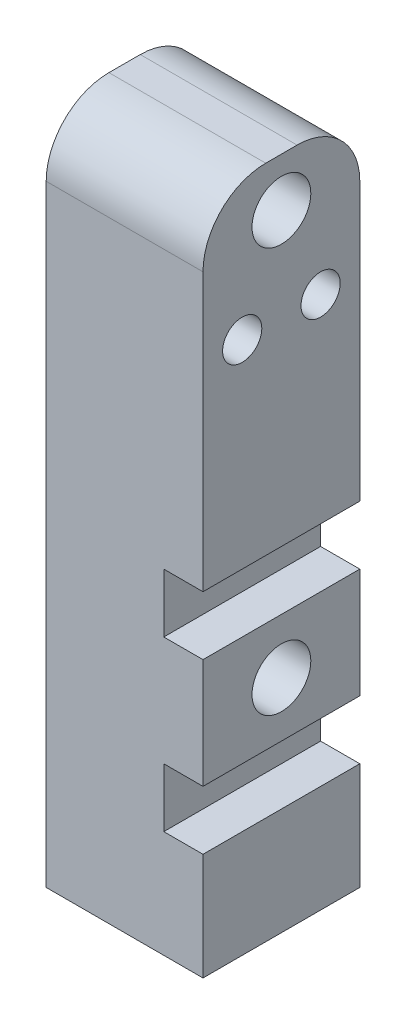
ISO-10303-21;
HEADER;
FILE_DESCRIPTION(('STEP AP214'),'2;1');
FILE_NAME('part.step','',(''),(''),'','','');
FILE_SCHEMA(('AUTOMOTIVE_DESIGN { 1 0 10303 214 1 1 1 1 }'));
ENDSEC;
DATA;
#1=APPLICATION_CONTEXT('core data for automotive mechanical design processes');
#2=APPLICATION_PROTOCOL_DEFINITION('international standard','automotive_design',2000,#1);
#3=PRODUCT_CONTEXT('',#1,'mechanical');
#4=PRODUCT('Part','Part','',(#3));
#5=PRODUCT_RELATED_PRODUCT_CATEGORY('part','',(#4));
#6=PRODUCT_DEFINITION_FORMATION('','',#4);
#7=PRODUCT_DEFINITION_CONTEXT('part definition',#1,'design');
#8=PRODUCT_DEFINITION('design','',#6,#7);
#9=PRODUCT_DEFINITION_SHAPE('','',#8);
#10=(LENGTH_UNIT() NAMED_UNIT(*) SI_UNIT(.MILLI.,.METRE.));
#11=(NAMED_UNIT(*) PLANE_ANGLE_UNIT() SI_UNIT($,.RADIAN.));
#12=(NAMED_UNIT(*) SI_UNIT($,.STERADIAN.) SOLID_ANGLE_UNIT());
#13=UNCERTAINTY_MEASURE_WITH_UNIT(LENGTH_MEASURE(1.E-05),#10,'distance_accuracy_value','');
#14=(GEOMETRIC_REPRESENTATION_CONTEXT(3) GLOBAL_UNCERTAINTY_ASSIGNED_CONTEXT((#13)) GLOBAL_UNIT_ASSIGNED_CONTEXT((#10,
#11,#12)) REPRESENTATION_CONTEXT('',''));
#15=CARTESIAN_POINT('',(0.,0.,0.));
#16=DIRECTION('',(0.,0.,1.));
#17=DIRECTION('',(1.,0.,0.));
#18=AXIS2_PLACEMENT_3D('',#15,#16,#17);
#19=CARTESIAN_POINT('',(25.4,0.,25.4));
#20=DIRECTION('',(0.,1.,0.));
#21=DIRECTION('',(0.,0.,1.));
#22=AXIS2_PLACEMENT_3D('',#19,#20,#21);
#23=PLANE('',#22);
#24=CARTESIAN_POINT('',(12.7,0.,12.7));
#25=DIRECTION('',(0.,-1.,0.));
#26=DIRECTION('',(0.,0.,-1.));
#27=AXIS2_PLACEMENT_3D('',#24,#25,#26);
#28=CIRCLE('',#27,3.175);
#29=CARTESIAN_POINT('',(12.7,0.,9.525));
#30=VERTEX_POINT('',#29);
#31=EDGE_CURVE('E549',#30,#30,#28,.T.);
#32=ORIENTED_EDGE('',*,*,#31,.F.);
#33=EDGE_LOOP('',(#32));
#34=FACE_BOUND('',#33,.T.);
#35=DIRECTION('',(1.,0.,0.));
#36=VECTOR('',#35,1.);
#37=CARTESIAN_POINT('',(25.4,0.,0.));
#38=LINE('',#37,#36);
#39=CARTESIAN_POINT('',(0.,0.,0.));
#40=VERTEX_POINT('',#39);
#41=CARTESIAN_POINT('',(25.4,0.,0.));
#42=VERTEX_POINT('',#41);
#43=EDGE_CURVE('E170',#40,#42,#38,.T.);
#44=ORIENTED_EDGE('',*,*,#43,.T.);
#45=DIRECTION('',(0.,0.,-1.));
#46=VECTOR('',#45,1.);
#47=CARTESIAN_POINT('',(25.4,0.,25.4));
#48=LINE('',#47,#46);
#49=CARTESIAN_POINT('',(25.4,0.,25.4));
#50=VERTEX_POINT('',#49);
#51=EDGE_CURVE('E151',#50,#42,#48,.T.);
#52=ORIENTED_EDGE('',*,*,#51,.F.);
#53=DIRECTION('',(1.,0.,0.));
#54=VECTOR('',#53,1.);
#55=CARTESIAN_POINT('',(25.4,0.,25.4));
#56=LINE('',#55,#54);
#57=CARTESIAN_POINT('',(0.,0.,25.4));
#58=VERTEX_POINT('',#57);
#59=EDGE_CURVE('E158',#58,#50,#56,.T.);
#60=ORIENTED_EDGE('',*,*,#59,.F.);
#61=DIRECTION('',(0.,0.,-1.));
#62=VECTOR('',#61,1.);
#63=CARTESIAN_POINT('',(0.,0.,25.4));
#64=LINE('',#63,#62);
#65=EDGE_CURVE('E211',#58,#40,#64,.T.);
#66=ORIENTED_EDGE('',*,*,#65,.T.);
#67=EDGE_LOOP('',(#44,#52,#60,#66));
#68=FACE_BOUND('',#67,.T.);
#69=ADVANCED_FACE('F42',(#34,#68),#23,.F.);
#70=CARTESIAN_POINT('',(25.4,17.3553714621183,25.4));
#71=DIRECTION('',(-1.,0.,0.));
#72=DIRECTION('',(0.,-1.,0.));
#73=AXIS2_PLACEMENT_3D('',#70,#71,#72);
#74=PLANE('',#73);
#75=DIRECTION('',(0.,1.,0.));
#76=VECTOR('',#75,1.);
#77=CARTESIAN_POINT('',(25.4,17.3553714621183,0.));
#78=LINE('',#77,#76);
#79=CARTESIAN_POINT('',(25.4,17.3553714621183,0.));
#80=VERTEX_POINT('',#79);
#81=EDGE_CURVE('E247',#42,#80,#78,.T.);
#82=ORIENTED_EDGE('',*,*,#81,.T.);
#83=DIRECTION('',(0.,0.,-1.));
#84=VECTOR('',#83,1.);
#85=CARTESIAN_POINT('',(25.4,17.3553714621183,25.4));
#86=LINE('',#85,#84);
#87=CARTESIAN_POINT('',(25.4,17.3553714621183,25.4));
#88=VERTEX_POINT('',#87);
#89=EDGE_CURVE('E154',#88,#80,#86,.T.);
#90=ORIENTED_EDGE('',*,*,#89,.F.);
#91=DIRECTION('',(0.,1.,0.));
#92=VECTOR('',#91,1.);
#93=CARTESIAN_POINT('',(25.4,17.3553714621183,25.4));
#94=LINE('',#93,#92);
#95=EDGE_CURVE('E147',#50,#88,#94,.T.);
#96=ORIENTED_EDGE('',*,*,#95,.F.);
#97=ORIENTED_EDGE('',*,*,#51,.T.);
#98=EDGE_LOOP('',(#82,#90,#96,#97));
#99=FACE_BOUND('',#98,.T.);
#100=ADVANCED_FACE('F149',(#99),#74,.F.);
#101=CARTESIAN_POINT('',(19.05,17.3553714621183,25.4));
#102=DIRECTION('',(0.,-1.,0.));
#103=DIRECTION('',(0.,0.,-1.));
#104=AXIS2_PLACEMENT_3D('',#101,#102,#103);
#105=PLANE('',#104);
#106=DIRECTION('',(-1.,0.,0.));
#107=VECTOR('',#106,1.);
#108=CARTESIAN_POINT('',(19.05,17.3553714621183,0.));
#109=LINE('',#108,#107);
#110=CARTESIAN_POINT('',(19.05,17.3553714621183,0.));
#111=VERTEX_POINT('',#110);
#112=EDGE_CURVE('E241',#80,#111,#109,.T.);
#113=ORIENTED_EDGE('',*,*,#112,.T.);
#114=DIRECTION('',(0.,0.,-1.));
#115=VECTOR('',#114,1.);
#116=CARTESIAN_POINT('',(19.05,17.3553714621183,25.4));
#117=LINE('',#116,#115);
#118=CARTESIAN_POINT('',(19.05,17.3553714621183,25.4));
#119=VERTEX_POINT('',#118);
#120=EDGE_CURVE('E175',#119,#111,#117,.T.);
#121=ORIENTED_EDGE('',*,*,#120,.F.);
#122=DIRECTION('',(-1.,0.,0.));
#123=VECTOR('',#122,1.);
#124=CARTESIAN_POINT('',(19.05,17.3553714621183,25.4));
#125=LINE('',#124,#123);
#126=EDGE_CURVE('E157',#88,#119,#125,.T.);
#127=ORIENTED_EDGE('',*,*,#126,.F.);
#128=ORIENTED_EDGE('',*,*,#89,.T.);
#129=EDGE_LOOP('',(#113,#121,#127,#128));
#130=FACE_BOUND('',#129,.T.);
#131=ADVANCED_FACE('F272',(#130),#105,.F.);
#132=CARTESIAN_POINT('',(19.05,26.8803714621183,25.4));
#133=DIRECTION('',(-1.,0.,0.));
#134=DIRECTION('',(0.,0.,1.));
#135=AXIS2_PLACEMENT_3D('',#132,#133,#134);
#136=PLANE('',#135);
#137=DIRECTION('',(0.,1.,0.));
#138=VECTOR('',#137,1.);
#139=CARTESIAN_POINT('',(19.05,26.8803714621183,0.));
#140=LINE('',#139,#138);
#141=CARTESIAN_POINT('',(19.05,26.8803714621183,0.));
#142=VERTEX_POINT('',#141);
#143=EDGE_CURVE('E236',#111,#142,#140,.T.);
#144=ORIENTED_EDGE('',*,*,#143,.T.);
#145=DIRECTION('',(0.,0.,-1.));
#146=VECTOR('',#145,1.);
#147=CARTESIAN_POINT('',(19.05,26.8803714621183,25.4));
#148=LINE('',#147,#146);
#149=CARTESIAN_POINT('',(19.05,26.8803714621183,25.4));
#150=VERTEX_POINT('',#149);
#151=EDGE_CURVE('E227',#150,#142,#148,.T.);
#152=ORIENTED_EDGE('',*,*,#151,.F.);
#153=DIRECTION('',(0.,1.,0.));
#154=VECTOR('',#153,1.);
#155=CARTESIAN_POINT('',(19.05,26.8803714621183,25.4));
#156=LINE('',#155,#154);
#157=EDGE_CURVE('E237',#119,#150,#156,.T.);
#158=ORIENTED_EDGE('',*,*,#157,.F.);
#159=ORIENTED_EDGE('',*,*,#120,.T.);
#160=EDGE_LOOP('',(#144,#152,#158,#159));
#161=FACE_BOUND('',#160,.T.);
#162=ADVANCED_FACE('F234',(#161),#136,.F.);
#163=CARTESIAN_POINT('',(25.4,26.8803714621183,25.4));
#164=DIRECTION('',(0.,1.,0.));
#165=DIRECTION('',(0.,0.,1.));
#166=AXIS2_PLACEMENT_3D('',#163,#164,#165);
#167=PLANE('',#166);
#168=DIRECTION('',(1.,0.,0.));
#169=VECTOR('',#168,1.);
#170=CARTESIAN_POINT('',(25.4,26.8803714621183,0.));
#171=LINE('',#170,#169);
#172=CARTESIAN_POINT('',(25.4,26.8803714621183,0.));
#173=VERTEX_POINT('',#172);
#174=EDGE_CURVE('E243',#142,#173,#171,.T.);
#175=ORIENTED_EDGE('',*,*,#174,.T.);
#176=DIRECTION('',(0.,0.,-1.));
#177=VECTOR('',#176,1.);
#178=CARTESIAN_POINT('',(25.4,26.8803714621183,25.4));
#179=LINE('',#178,#177);
#180=CARTESIAN_POINT('',(25.4,26.8803714621183,25.4));
#181=VERTEX_POINT('',#180);
#182=EDGE_CURVE('E224',#181,#173,#179,.T.);
#183=ORIENTED_EDGE('',*,*,#182,.F.);
#184=DIRECTION('',(1.,0.,0.));
#185=VECTOR('',#184,1.);
#186=CARTESIAN_POINT('',(25.4,26.8803714621183,25.4));
#187=LINE('',#186,#185);
#188=EDGE_CURVE('E274',#150,#181,#187,.T.);
#189=ORIENTED_EDGE('',*,*,#188,.F.);
#190=ORIENTED_EDGE('',*,*,#151,.T.);
#191=EDGE_LOOP('',(#175,#183,#189,#190));
#192=FACE_BOUND('',#191,.T.);
#193=ADVANCED_FACE('F296',(#192),#167,.F.);
#194=CARTESIAN_POINT('',(25.4,44.6603714621183,25.4));
#195=DIRECTION('',(-1.,0.,0.));
#196=DIRECTION('',(0.,0.,1.));
#197=AXIS2_PLACEMENT_3D('',#194,#195,#196);
#198=PLANE('',#197);
#199=CARTESIAN_POINT('',(25.4,35.7703714621183,12.7));
#200=DIRECTION('',(1.,0.,0.));
#201=DIRECTION('',(0.,0.,-1.));
#202=AXIS2_PLACEMENT_3D('',#199,#200,#201);
#203=CIRCLE('',#202,4.7625);
#204=CARTESIAN_POINT('',(25.4,35.7703714621183,7.9375));
#205=VERTEX_POINT('',#204);
#206=EDGE_CURVE('E563',#205,#205,#203,.T.);
#207=ORIENTED_EDGE('',*,*,#206,.F.);
#208=EDGE_LOOP('',(#207));
#209=FACE_BOUND('',#208,.T.);
#210=DIRECTION('',(0.,1.,0.));
#211=VECTOR('',#210,1.);
#212=CARTESIAN_POINT('',(25.4,44.6603714621183,0.));
#213=LINE('',#212,#211);
#214=CARTESIAN_POINT('',(25.4,44.6603714621183,0.));
#215=VERTEX_POINT('',#214);
#216=EDGE_CURVE('E245',#173,#215,#213,.T.);
#217=ORIENTED_EDGE('',*,*,#216,.T.);
#218=DIRECTION('',(0.,0.,-1.));
#219=VECTOR('',#218,1.);
#220=CARTESIAN_POINT('',(25.4,44.6603714621183,25.4));
#221=LINE('',#220,#219);
#222=CARTESIAN_POINT('',(25.4,44.6603714621183,25.4));
#223=VERTEX_POINT('',#222);
#224=EDGE_CURVE('E221',#223,#215,#221,.T.);
#225=ORIENTED_EDGE('',*,*,#224,.F.);
#226=DIRECTION('',(0.,1.,0.));
#227=VECTOR('',#226,1.);
#228=CARTESIAN_POINT('',(25.4,44.6603714621183,25.4));
#229=LINE('',#228,#227);
#230=EDGE_CURVE('E278',#181,#223,#229,.T.);
#231=ORIENTED_EDGE('',*,*,#230,.F.);
#232=ORIENTED_EDGE('',*,*,#182,.T.);
#233=EDGE_LOOP('',(#217,#225,#231,#232));
#234=FACE_BOUND('',#233,.T.);
#235=ADVANCED_FACE('F292',(#209,#234),#198,.F.);
#236=CARTESIAN_POINT('',(19.05,44.6603714621183,25.4));
#237=DIRECTION('',(0.,-1.,0.));
#238=DIRECTION('',(1.,0.,0.));
#239=AXIS2_PLACEMENT_3D('',#236,#237,#238);
#240=PLANE('',#239);
#241=DIRECTION('',(-1.,0.,0.));
#242=VECTOR('',#241,1.);
#243=CARTESIAN_POINT('',(19.05,44.6603714621183,0.));
#244=LINE('',#243,#242);
#245=CARTESIAN_POINT('',(19.05,44.6603714621183,0.));
#246=VERTEX_POINT('',#245);
#247=EDGE_CURVE('E252',#215,#246,#244,.T.);
#248=ORIENTED_EDGE('',*,*,#247,.T.);
#249=DIRECTION('',(0.,0.,-1.));
#250=VECTOR('',#249,1.);
#251=CARTESIAN_POINT('',(19.05,44.6603714621183,25.4));
#252=LINE('',#251,#250);
#253=CARTESIAN_POINT('',(19.05,44.6603714621183,25.4));
#254=VERTEX_POINT('',#253);
#255=EDGE_CURVE('E218',#254,#246,#252,.T.);
#256=ORIENTED_EDGE('',*,*,#255,.F.);
#257=DIRECTION('',(-1.,0.,0.));
#258=VECTOR('',#257,1.);
#259=CARTESIAN_POINT('',(19.05,44.6603714621183,25.4));
#260=LINE('',#259,#258);
#261=EDGE_CURVE('E280',#223,#254,#260,.T.);
#262=ORIENTED_EDGE('',*,*,#261,.F.);
#263=ORIENTED_EDGE('',*,*,#224,.T.);
#264=EDGE_LOOP('',(#248,#256,#262,#263));
#265=FACE_BOUND('',#264,.T.);
#266=ADVANCED_FACE('F288',(#265),#240,.F.);
#267=CARTESIAN_POINT('',(19.05,54.1853714621183,25.4));
#268=DIRECTION('',(-1.,0.,0.));
#269=DIRECTION('',(0.,0.,1.));
#270=AXIS2_PLACEMENT_3D('',#267,#268,#269);
#271=PLANE('',#270);
#272=DIRECTION('',(0.,1.,0.));
#273=VECTOR('',#272,1.);
#274=CARTESIAN_POINT('',(19.05,54.1853714621183,0.));
#275=LINE('',#274,#273);
#276=CARTESIAN_POINT('',(19.05,54.1853714621183,0.));
#277=VERTEX_POINT('',#276);
#278=EDGE_CURVE('E254',#246,#277,#275,.T.);
#279=ORIENTED_EDGE('',*,*,#278,.T.);
#280=DIRECTION('',(0.,0.,-1.));
#281=VECTOR('',#280,1.);
#282=CARTESIAN_POINT('',(19.05,54.1853714621183,25.4));
#283=LINE('',#282,#281);
#284=CARTESIAN_POINT('',(19.05,54.1853714621183,25.4));
#285=VERTEX_POINT('',#284);
#286=EDGE_CURVE('E215',#285,#277,#283,.T.);
#287=ORIENTED_EDGE('',*,*,#286,.F.);
#288=DIRECTION('',(0.,1.,0.));
#289=VECTOR('',#288,1.);
#290=CARTESIAN_POINT('',(19.05,54.1853714621183,25.4));
#291=LINE('',#290,#289);
#292=EDGE_CURVE('E267',#254,#285,#291,.T.);
#293=ORIENTED_EDGE('',*,*,#292,.F.);
#294=ORIENTED_EDGE('',*,*,#255,.T.);
#295=EDGE_LOOP('',(#279,#287,#293,#294));
#296=FACE_BOUND('',#295,.T.);
#297=ADVANCED_FACE('F285',(#296),#271,.F.);
#298=CARTESIAN_POINT('',(25.4,54.1853714621183,25.4));
#299=DIRECTION('',(0.,1.,0.));
#300=DIRECTION('',(-1.,0.,0.));
#301=AXIS2_PLACEMENT_3D('',#298,#299,#300);
#302=PLANE('',#301);
#303=DIRECTION('',(1.,0.,0.));
#304=VECTOR('',#303,1.);
#305=CARTESIAN_POINT('',(25.4,54.1853714621183,0.));
#306=LINE('',#305,#304);
#307=CARTESIAN_POINT('',(25.4,54.1853714621183,0.));
#308=VERTEX_POINT('',#307);
#309=EDGE_CURVE('E207',#277,#308,#306,.T.);
#310=ORIENTED_EDGE('',*,*,#309,.T.);
#311=DIRECTION('',(0.,0.,-1.));
#312=VECTOR('',#311,1.);
#313=CARTESIAN_POINT('',(25.4,54.1853714621183,25.4));
#314=LINE('',#313,#312);
#315=CARTESIAN_POINT('',(25.4,54.1853714621183,25.4));
#316=VERTEX_POINT('',#315);
#317=EDGE_CURVE('E199',#316,#308,#314,.T.);
#318=ORIENTED_EDGE('',*,*,#317,.F.);
#319=DIRECTION('',(1.,0.,0.));
#320=VECTOR('',#319,1.);
#321=CARTESIAN_POINT('',(25.4,54.1853714621183,25.4));
#322=LINE('',#321,#320);
#323=EDGE_CURVE('E264',#285,#316,#322,.T.);
#324=ORIENTED_EDGE('',*,*,#323,.F.);
#325=ORIENTED_EDGE('',*,*,#286,.T.);
#326=EDGE_LOOP('',(#310,#318,#324,#325));
#327=FACE_BOUND('',#326,.T.);
#328=ADVANCED_FACE('F258',(#327),#302,.F.);
#329=CARTESIAN_POINT('',(25.4,109.22,25.4));
#330=DIRECTION('',(-1.,0.,0.));
#331=DIRECTION('',(0.,-1.,0.));
#332=AXIS2_PLACEMENT_3D('',#329,#330,#331);
#333=PLANE('',#332);
#334=CARTESIAN_POINT('',(25.4,101.346,12.7));
#335=DIRECTION('',(1.,0.,0.));
#336=DIRECTION('',(0.,1.,0.));
#337=AXIS2_PLACEMENT_3D('',#334,#335,#336);
#338=CIRCLE('',#337,4.7625);
#339=CARTESIAN_POINT('',(25.4,106.1085,12.7));
#340=VERTEX_POINT('',#339);
#341=EDGE_CURVE('E548',#340,#340,#338,.T.);
#342=ORIENTED_EDGE('',*,*,#341,.F.);
#343=EDGE_LOOP('',(#342));
#344=FACE_BOUND('',#343,.T.);
#345=CARTESIAN_POINT('',(25.4,86.36,19.05));
#346=DIRECTION('',(1.,0.,0.));
#347=DIRECTION('',(0.,1.,0.));
#348=AXIS2_PLACEMENT_3D('',#345,#346,#347);
#349=CIRCLE('',#348,3.175);
#350=CARTESIAN_POINT('',(25.4,89.535,19.05));
#351=VERTEX_POINT('',#350);
#352=EDGE_CURVE('E564',#351,#351,#349,.T.);
#353=ORIENTED_EDGE('',*,*,#352,.F.);
#354=EDGE_LOOP('',(#353));
#355=FACE_BOUND('',#354,.T.);
#356=CARTESIAN_POINT('',(25.4,86.36,6.35));
#357=DIRECTION('',(1.,0.,0.));
#358=DIRECTION('',(0.,1.,0.));
#359=AXIS2_PLACEMENT_3D('',#356,#357,#358);
#360=CIRCLE('',#359,3.175);
#361=CARTESIAN_POINT('',(25.4,89.535,6.35));
#362=VERTEX_POINT('',#361);
#363=EDGE_CURVE('E567',#362,#362,#360,.T.);
#364=ORIENTED_EDGE('',*,*,#363,.F.);
#365=EDGE_LOOP('',(#364));
#366=FACE_BOUND('',#365,.T.);
#367=DIRECTION('',(0.,1.,0.));
#368=VECTOR('',#367,1.);
#369=CARTESIAN_POINT('',(25.4,109.22,0.));
#370=LINE('',#369,#368);
#371=CARTESIAN_POINT('',(25.4,99.06,0.));
#372=VERTEX_POINT('',#371);
#373=EDGE_CURVE('E191',#308,#372,#370,.T.);
#374=ORIENTED_EDGE('',*,*,#373,.T.);
#375=CARTESIAN_POINT('',(25.4,99.06,10.16));
#376=DIRECTION('',(-1.,0.,0.));
#377=DIRECTION('',(0.,-1.,0.));
#378=AXIS2_PLACEMENT_3D('',#375,#376,#377);
#379=CIRCLE('',#378,10.16);
#380=CARTESIAN_POINT('',(25.4,109.22,10.16));
#381=VERTEX_POINT('',#380);
#382=EDGE_CURVE('E50',#372,#381,#379,.F.);
#383=ORIENTED_EDGE('',*,*,#382,.T.);
#384=DIRECTION('',(0.,0.,-1.));
#385=VECTOR('',#384,1.);
#386=CARTESIAN_POINT('',(25.4,109.22,25.4));
#387=LINE('',#386,#385);
#388=CARTESIAN_POINT('',(25.4,109.22,15.24));
#389=VERTEX_POINT('',#388);
#390=EDGE_CURVE('E189',#389,#381,#387,.T.);
#391=ORIENTED_EDGE('',*,*,#390,.F.);
#392=CARTESIAN_POINT('',(25.4,99.06,15.24));
#393=DIRECTION('',(-1.,0.,0.));
#394=DIRECTION('',(0.,-1.,0.));
#395=AXIS2_PLACEMENT_3D('',#392,#393,#394);
#396=CIRCLE('',#395,10.16);
#397=CARTESIAN_POINT('',(25.4,99.06,25.4));
#398=VERTEX_POINT('',#397);
#399=EDGE_CURVE('E57',#389,#398,#396,.F.);
#400=ORIENTED_EDGE('',*,*,#399,.T.);
#401=DIRECTION('',(0.,1.,0.));
#402=VECTOR('',#401,1.);
#403=CARTESIAN_POINT('',(25.4,109.22,25.4));
#404=LINE('',#403,#402);
#405=EDGE_CURVE('E262',#316,#398,#404,.T.);
#406=ORIENTED_EDGE('',*,*,#405,.F.);
#407=ORIENTED_EDGE('',*,*,#317,.T.);
#408=EDGE_LOOP('',(#374,#383,#391,#400,#406,#407));
#409=FACE_BOUND('',#408,.T.);
#410=ADVANCED_FACE('F188',(#344,#355,#366,#409),#333,.F.);
#411=CARTESIAN_POINT('',(0.,109.22,25.4));
#412=DIRECTION('',(0.,-1.,0.));
#413=DIRECTION('',(0.,0.,-1.));
#414=AXIS2_PLACEMENT_3D('',#411,#412,#413);
#415=PLANE('',#414);
#416=ORIENTED_EDGE('',*,*,#390,.T.);
#417=DIRECTION('',(-1.,0.,0.));
#418=VECTOR('',#417,1.);
#419=CARTESIAN_POINT('',(0.,109.22,10.16));
#420=LINE('',#419,#418);
#421=CARTESIAN_POINT('',(0.,109.22,10.16));
#422=VERTEX_POINT('',#421);
#423=EDGE_CURVE('E173',#381,#422,#420,.T.);
#424=ORIENTED_EDGE('',*,*,#423,.T.);
#425=DIRECTION('',(0.,0.,-1.));
#426=VECTOR('',#425,1.);
#427=CARTESIAN_POINT('',(0.,109.22,25.4));
#428=LINE('',#427,#426);
#429=CARTESIAN_POINT('',(0.,109.22,15.24));
#430=VERTEX_POINT('',#429);
#431=EDGE_CURVE('E200',#430,#422,#428,.T.);
#432=ORIENTED_EDGE('',*,*,#431,.F.);
#433=DIRECTION('',(-1.,0.,0.));
#434=VECTOR('',#433,1.);
#435=CARTESIAN_POINT('',(0.,109.22,15.24));
#436=LINE('',#435,#434);
#437=EDGE_CURVE('E171',#430,#389,#436,.F.);
#438=ORIENTED_EDGE('',*,*,#437,.T.);
#439=EDGE_LOOP('',(#416,#424,#432,#438));
#440=FACE_BOUND('',#439,.T.);
#441=ADVANCED_FACE('F195',(#440),#415,.F.);
#442=CARTESIAN_POINT('',(0.,0.,25.4));
#443=DIRECTION('',(1.,0.,0.));
#444=DIRECTION('',(0.,0.,-1.));
#445=AXIS2_PLACEMENT_3D('',#442,#443,#444);
#446=PLANE('',#445);
#447=CARTESIAN_POINT('',(0.,86.36,19.05));
#448=DIRECTION('',(1.,0.,0.));
#449=DIRECTION('',(0.,1.,0.));
#450=AXIS2_PLACEMENT_3D('',#447,#448,#449);
#451=CIRCLE('',#450,3.175);
#452=CARTESIAN_POINT('',(0.,89.535,19.05));
#453=VERTEX_POINT('',#452);
#454=EDGE_CURVE('E560',#453,#453,#451,.T.);
#455=ORIENTED_EDGE('',*,*,#454,.T.);
#456=EDGE_LOOP('',(#455));
#457=FACE_BOUND('',#456,.T.);
#458=CARTESIAN_POINT('',(0.,86.36,6.35));
#459=DIRECTION('',(1.,0.,0.));
#460=DIRECTION('',(0.,1.,0.));
#461=AXIS2_PLACEMENT_3D('',#458,#459,#460);
#462=CIRCLE('',#461,3.175);
#463=CARTESIAN_POINT('',(0.,89.535,6.35));
#464=VERTEX_POINT('',#463);
#465=EDGE_CURVE('E558',#464,#464,#462,.T.);
#466=ORIENTED_EDGE('',*,*,#465,.T.);
#467=EDGE_LOOP('',(#466));
#468=FACE_BOUND('',#467,.T.);
#469=CARTESIAN_POINT('',(0.,35.7703714621183,12.7));
#470=DIRECTION('',(1.,0.,0.));
#471=DIRECTION('',(0.,0.,-1.));
#472=AXIS2_PLACEMENT_3D('',#469,#470,#471);
#473=CIRCLE('',#472,4.7625);
#474=CARTESIAN_POINT('',(0.,35.7703714621183,7.9375));
#475=VERTEX_POINT('',#474);
#476=EDGE_CURVE('E271',#475,#475,#473,.T.);
#477=ORIENTED_EDGE('',*,*,#476,.T.);
#478=EDGE_LOOP('',(#477));
#479=FACE_BOUND('',#478,.T.);
#480=ORIENTED_EDGE('',*,*,#431,.T.);
#481=CARTESIAN_POINT('',(0.,99.06,10.16));
#482=DIRECTION('',(1.,0.,0.));
#483=DIRECTION('',(0.,0.,-1.));
#484=AXIS2_PLACEMENT_3D('',#481,#482,#483);
#485=CIRCLE('',#484,10.16);
#486=CARTESIAN_POINT('',(0.,99.06,0.));
#487=VERTEX_POINT('',#486);
#488=EDGE_CURVE('E183',#422,#487,#485,.F.);
#489=ORIENTED_EDGE('',*,*,#488,.T.);
#490=DIRECTION('',(0.,-1.,0.));
#491=VECTOR('',#490,1.);
#492=CARTESIAN_POINT('',(0.,0.,0.));
#493=LINE('',#492,#491);
#494=EDGE_CURVE('E167',#487,#40,#493,.T.);
#495=ORIENTED_EDGE('',*,*,#494,.T.);
#496=ORIENTED_EDGE('',*,*,#65,.F.);
#497=DIRECTION('',(0.,-1.,0.));
#498=VECTOR('',#497,1.);
#499=CARTESIAN_POINT('',(0.,0.,25.4));
#500=LINE('',#499,#498);
#501=CARTESIAN_POINT('',(0.,99.06,25.4));
#502=VERTEX_POINT('',#501);
#503=EDGE_CURVE('E163',#502,#58,#500,.T.);
#504=ORIENTED_EDGE('',*,*,#503,.F.);
#505=CARTESIAN_POINT('',(0.,99.06,15.24));
#506=DIRECTION('',(1.,0.,0.));
#507=DIRECTION('',(0.,0.,-1.));
#508=AXIS2_PLACEMENT_3D('',#505,#506,#507);
#509=CIRCLE('',#508,10.16);
#510=EDGE_CURVE('E181',#502,#430,#509,.F.);
#511=ORIENTED_EDGE('',*,*,#510,.T.);
#512=EDGE_LOOP('',(#480,#489,#495,#496,#504,#511));
#513=FACE_BOUND('',#512,.T.);
#514=ADVANCED_FACE('F204',(#457,#468,#479,#513),#446,.F.);
#515=CARTESIAN_POINT('',(0.,0.,25.4));
#516=DIRECTION('',(0.,0.,-1.));
#517=DIRECTION('',(-1.,0.,0.));
#518=AXIS2_PLACEMENT_3D('',#515,#516,#517);
#519=PLANE('',#518);
#520=ORIENTED_EDGE('',*,*,#405,.T.);
#521=DIRECTION('',(-1.,0.,0.));
#522=VECTOR('',#521,1.);
#523=CARTESIAN_POINT('',(0.,99.06,25.4));
#524=LINE('',#523,#522);
#525=EDGE_CURVE('E11',#398,#502,#524,.T.);
#526=ORIENTED_EDGE('',*,*,#525,.T.);
#527=ORIENTED_EDGE('',*,*,#503,.T.);
#528=ORIENTED_EDGE('',*,*,#59,.T.);
#529=ORIENTED_EDGE('',*,*,#95,.T.);
#530=ORIENTED_EDGE('',*,*,#126,.T.);
#531=ORIENTED_EDGE('',*,*,#157,.T.);
#532=ORIENTED_EDGE('',*,*,#188,.T.);
#533=ORIENTED_EDGE('',*,*,#230,.T.);
#534=ORIENTED_EDGE('',*,*,#261,.T.);
#535=ORIENTED_EDGE('',*,*,#292,.T.);
#536=ORIENTED_EDGE('',*,*,#323,.T.);
#537=EDGE_LOOP('',(#520,#526,#527,#528,#529,#530,#531,#532,#533,#534,#535,#536));
#538=FACE_BOUND('',#537,.T.);
#539=ADVANCED_FACE('F161',(#538),#519,.F.);
#540=CARTESIAN_POINT('',(0.,0.,0.));
#541=DIRECTION('',(0.,0.,-1.));
#542=DIRECTION('',(-1.,0.,0.));
#543=AXIS2_PLACEMENT_3D('',#540,#541,#542);
#544=PLANE('',#543);
#545=ORIENTED_EDGE('',*,*,#494,.F.);
#546=DIRECTION('',(-1.,0.,0.));
#547=VECTOR('',#546,1.);
#548=CARTESIAN_POINT('',(25.4,99.06,0.));
#549=LINE('',#548,#547);
#550=EDGE_CURVE('E65',#487,#372,#549,.F.);
#551=ORIENTED_EDGE('',*,*,#550,.T.);
#552=ORIENTED_EDGE('',*,*,#373,.F.);
#553=ORIENTED_EDGE('',*,*,#309,.F.);
#554=ORIENTED_EDGE('',*,*,#278,.F.);
#555=ORIENTED_EDGE('',*,*,#247,.F.);
#556=ORIENTED_EDGE('',*,*,#216,.F.);
#557=ORIENTED_EDGE('',*,*,#174,.F.);
#558=ORIENTED_EDGE('',*,*,#143,.F.);
#559=ORIENTED_EDGE('',*,*,#112,.F.);
#560=ORIENTED_EDGE('',*,*,#81,.F.);
#561=ORIENTED_EDGE('',*,*,#43,.F.);
#562=EDGE_LOOP('',(#545,#551,#552,#553,#554,#555,#556,#557,#558,#559,#560,#561));
#563=FACE_BOUND('',#562,.T.);
#564=ADVANCED_FACE('F205',(#563),#544,.T.);
#565=CARTESIAN_POINT('',(0.,99.06,10.16));
#566=DIRECTION('',(1.,0.,0.));
#567=DIRECTION('',(0.,0.,-1.));
#568=AXIS2_PLACEMENT_3D('',#565,#566,#567);
#569=CYLINDRICAL_SURFACE('',#568,10.16);
#570=ORIENTED_EDGE('',*,*,#382,.F.);
#571=ORIENTED_EDGE('',*,*,#550,.F.);
#572=ORIENTED_EDGE('',*,*,#488,.F.);
#573=ORIENTED_EDGE('',*,*,#423,.F.);
#574=EDGE_LOOP('',(#570,#571,#572,#573));
#575=FACE_BOUND('',#574,.T.);
#576=ADVANCED_FACE('F202',(#575),#569,.T.);
#577=CARTESIAN_POINT('',(0.,99.06,15.24));
#578=DIRECTION('',(-1.,0.,0.));
#579=DIRECTION('',(0.,0.,1.));
#580=AXIS2_PLACEMENT_3D('',#577,#578,#579);
#581=CYLINDRICAL_SURFACE('',#580,10.16);
#582=ORIENTED_EDGE('',*,*,#399,.F.);
#583=ORIENTED_EDGE('',*,*,#437,.F.);
#584=ORIENTED_EDGE('',*,*,#510,.F.);
#585=ORIENTED_EDGE('',*,*,#525,.F.);
#586=EDGE_LOOP('',(#582,#583,#584,#585));
#587=FACE_BOUND('',#586,.T.);
#588=ADVANCED_FACE('F44',(#587),#581,.T.);
#589=CARTESIAN_POINT('',(0.,35.7703714621183,12.7));
#590=DIRECTION('',(1.,0.,0.));
#591=DIRECTION('',(0.,0.,-1.));
#592=AXIS2_PLACEMENT_3D('',#589,#590,#591);
#593=CYLINDRICAL_SURFACE('',#592,4.7625);
#594=ORIENTED_EDGE('',*,*,#476,.F.);
#595=EDGE_LOOP('',(#594));
#596=FACE_BOUND('',#595,.T.);
#597=ORIENTED_EDGE('',*,*,#206,.T.);
#598=EDGE_LOOP('',(#597));
#599=FACE_BOUND('',#598,.T.);
#600=ADVANCED_FACE('F322',(#596,#599),#593,.F.);
#601=CARTESIAN_POINT('',(0.,86.36,6.35));
#602=DIRECTION('',(1.,0.,0.));
#603=DIRECTION('',(0.,1.,0.));
#604=AXIS2_PLACEMENT_3D('',#601,#602,#603);
#605=CYLINDRICAL_SURFACE('',#604,3.175);
#606=ORIENTED_EDGE('',*,*,#465,.F.);
#607=EDGE_LOOP('',(#606));
#608=FACE_BOUND('',#607,.T.);
#609=ORIENTED_EDGE('',*,*,#363,.T.);
#610=EDGE_LOOP('',(#609));
#611=FACE_BOUND('',#610,.T.);
#612=ADVANCED_FACE('F407',(#608,#611),#605,.F.);
#613=CARTESIAN_POINT('',(0.,86.36,19.05));
#614=DIRECTION('',(1.,0.,0.));
#615=DIRECTION('',(0.,1.,0.));
#616=AXIS2_PLACEMENT_3D('',#613,#614,#615);
#617=CYLINDRICAL_SURFACE('',#616,3.175);
#618=ORIENTED_EDGE('',*,*,#454,.F.);
#619=EDGE_LOOP('',(#618));
#620=FACE_BOUND('',#619,.T.);
#621=ORIENTED_EDGE('',*,*,#352,.T.);
#622=EDGE_LOOP('',(#621));
#623=FACE_BOUND('',#622,.T.);
#624=ADVANCED_FACE('F417',(#620,#623),#617,.F.);
#625=CARTESIAN_POINT('',(8.88999999999998,101.346,12.7));
#626=DIRECTION('',(1.,0.,0.));
#627=DIRECTION('',(0.,1.,0.));
#628=AXIS2_PLACEMENT_3D('',#625,#626,#627);
#629=CYLINDRICAL_SURFACE('',#628,4.7625);
#630=CARTESIAN_POINT('',(8.88999999999998,101.346,12.7));
#631=DIRECTION('',(1.,0.,0.));
#632=DIRECTION('',(0.,1.,0.));
#633=AXIS2_PLACEMENT_3D('',#630,#631,#632);
#634=CIRCLE('',#633,4.7625);
#635=CARTESIAN_POINT('',(8.88999999999998,106.1085,12.7));
#636=VERTEX_POINT('',#635);
#637=EDGE_CURVE('E552',#636,#636,#634,.T.);
#638=ORIENTED_EDGE('',*,*,#637,.F.);
#639=EDGE_LOOP('',(#638));
#640=FACE_BOUND('',#639,.T.);
#641=ORIENTED_EDGE('',*,*,#341,.T.);
#642=EDGE_LOOP('',(#641));
#643=FACE_BOUND('',#642,.T.);
#644=ADVANCED_FACE('F423',(#640,#643),#629,.F.);
#645=CARTESIAN_POINT('',(8.88999999999998,101.346,12.7));
#646=DIRECTION('',(1.,0.,0.));
#647=DIRECTION('',(0.,1.,0.));
#648=AXIS2_PLACEMENT_3D('',#645,#646,#647);
#649=PLANE('',#648);
#650=ORIENTED_EDGE('',*,*,#637,.T.);
#651=EDGE_LOOP('',(#650));
#652=FACE_BOUND('',#651,.T.);
#653=ADVANCED_FACE('F430',(#652),#649,.T.);
#654=CARTESIAN_POINT('',(12.7,17.78,12.7));
#655=DIRECTION('',(0.,-1.,0.));
#656=DIRECTION('',(0.,0.,-1.));
#657=AXIS2_PLACEMENT_3D('',#654,#655,#656);
#658=CYLINDRICAL_SURFACE('',#657,3.175);
#659=CARTESIAN_POINT('',(12.7,17.78,12.7));
#660=DIRECTION('',(0.,-1.,0.));
#661=DIRECTION('',(0.,0.,-1.));
#662=AXIS2_PLACEMENT_3D('',#659,#660,#661);
#663=CIRCLE('',#662,3.175);
#664=CARTESIAN_POINT('',(12.7,17.78,9.525));
#665=VERTEX_POINT('',#664);
#666=EDGE_CURVE('E547',#665,#665,#663,.T.);
#667=ORIENTED_EDGE('',*,*,#666,.F.);
#668=EDGE_LOOP('',(#667));
#669=FACE_BOUND('',#668,.T.);
#670=ORIENTED_EDGE('',*,*,#31,.T.);
#671=EDGE_LOOP('',(#670));
#672=FACE_BOUND('',#671,.T.);
#673=ADVANCED_FACE('F437',(#669,#672),#658,.F.);
#674=CARTESIAN_POINT('',(12.7,17.78,12.7));
#675=DIRECTION('',(0.,-1.,0.));
#676=DIRECTION('',(0.,0.,-1.));
#677=AXIS2_PLACEMENT_3D('',#674,#675,#676);
#678=PLANE('',#677);
#679=ORIENTED_EDGE('',*,*,#666,.T.);
#680=EDGE_LOOP('',(#679));
#681=FACE_BOUND('',#680,.T.);
#682=ADVANCED_FACE('F444',(#681),#678,.T.);
#683=CLOSED_SHELL('',(#69,#100,#131,#162,#193,#235,#266,#297,#328,#410,#441,#514,#539,#564,#576,
#588,#600,#612,#624,#644,#653,#673,#682));
#684=MANIFOLD_SOLID_BREP('B2',#683);
#685=ADVANCED_BREP_SHAPE_REPRESENTATION('',(#18,#684),#14);
#686=SHAPE_DEFINITION_REPRESENTATION(#9,#685);
ENDSEC;
END-ISO-10303-21;
